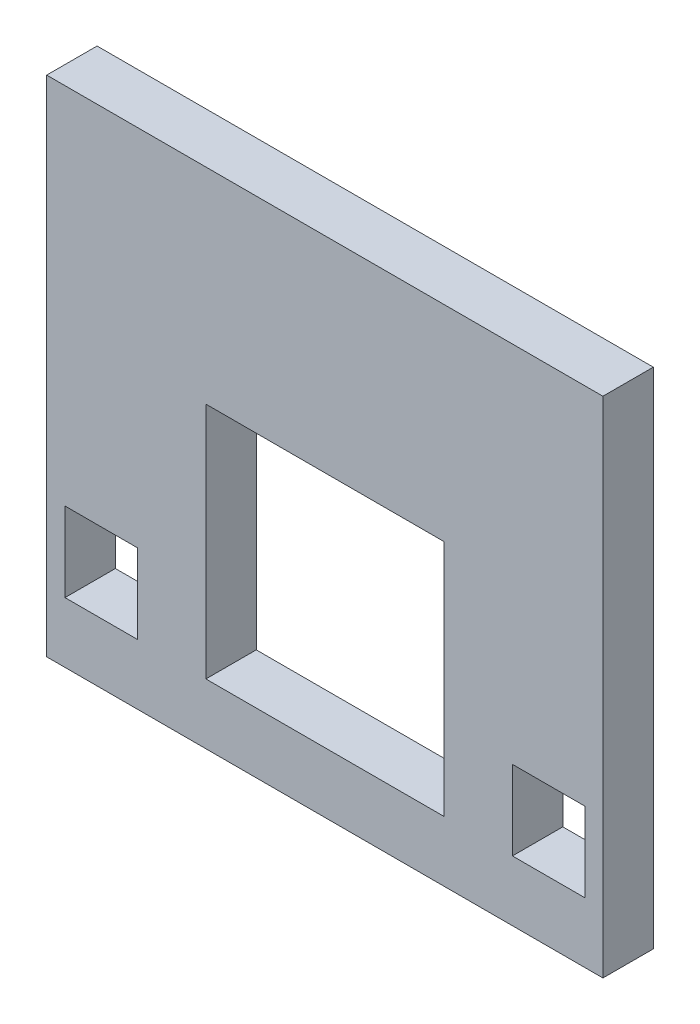
ISO-10303-21;
HEADER;
FILE_DESCRIPTION(('STEP AP214'),'2;1');
FILE_NAME('part.step','',(''),(''),'','','');
FILE_SCHEMA(('AUTOMOTIVE_DESIGN { 1 0 10303 214 1 1 1 1 }'));
ENDSEC;
DATA;
#1=APPLICATION_CONTEXT('core data for automotive mechanical design processes');
#2=APPLICATION_PROTOCOL_DEFINITION('international standard','automotive_design',2000,#1);
#3=PRODUCT_CONTEXT('',#1,'mechanical');
#4=PRODUCT('Part','Part','',(#3));
#5=PRODUCT_RELATED_PRODUCT_CATEGORY('part','',(#4));
#6=PRODUCT_DEFINITION_FORMATION('','',#4);
#7=PRODUCT_DEFINITION_CONTEXT('part definition',#1,'design');
#8=PRODUCT_DEFINITION('design','',#6,#7);
#9=PRODUCT_DEFINITION_SHAPE('','',#8);
#10=(LENGTH_UNIT() NAMED_UNIT(*) SI_UNIT(.MILLI.,.METRE.));
#11=(NAMED_UNIT(*) PLANE_ANGLE_UNIT() SI_UNIT($,.RADIAN.));
#12=(NAMED_UNIT(*) SI_UNIT($,.STERADIAN.) SOLID_ANGLE_UNIT());
#13=UNCERTAINTY_MEASURE_WITH_UNIT(LENGTH_MEASURE(1.E-05),#10,'distance_accuracy_value','');
#14=(GEOMETRIC_REPRESENTATION_CONTEXT(3) GLOBAL_UNCERTAINTY_ASSIGNED_CONTEXT((#13)) GLOBAL_UNIT_ASSIGNED_CONTEXT((#10,
#11,#12)) REPRESENTATION_CONTEXT('',''));
#15=CARTESIAN_POINT('',(0.,0.,0.));
#16=DIRECTION('',(0.,0.,1.));
#17=DIRECTION('',(1.,0.,0.));
#18=AXIS2_PLACEMENT_3D('',#15,#16,#17);
#19=CARTESIAN_POINT('',(9.77039111832267,30.8752429906542,3.175));
#20=DIRECTION('',(1.,0.,0.));
#21=DIRECTION('',(0.,1.,0.));
#22=AXIS2_PLACEMENT_3D('',#19,#20,#21);
#23=PLANE('',#22);
#24=DIRECTION('',(0.,-1.,0.));
#25=VECTOR('',#24,1.);
#26=CARTESIAN_POINT('',(9.77039111832267,30.8752429906542,0.));
#27=LINE('',#26,#25);
#28=CARTESIAN_POINT('',(9.77039111832267,30.8752429906542,0.));
#29=VERTEX_POINT('',#28);
#30=CARTESIAN_POINT('',(9.77039111832267,-0.874757009345785,0.));
#31=VERTEX_POINT('',#30);
#32=EDGE_CURVE('E275',#29,#31,#27,.T.);
#33=ORIENTED_EDGE('',*,*,#32,.T.);
#34=DIRECTION('',(0.,0.,-1.));
#35=VECTOR('',#34,1.);
#36=CARTESIAN_POINT('',(9.77039111832267,-0.874757009345785,3.175));
#37=LINE('',#36,#35);
#38=CARTESIAN_POINT('',(9.77039111832267,-0.874757009345785,3.175));
#39=VERTEX_POINT('',#38);
#40=EDGE_CURVE('E11',#39,#31,#37,.T.);
#41=ORIENTED_EDGE('',*,*,#40,.F.);
#42=DIRECTION('',(0.,-1.,0.));
#43=VECTOR('',#42,1.);
#44=CARTESIAN_POINT('',(9.77039111832267,30.8752429906542,3.175));
#45=LINE('',#44,#43);
#46=CARTESIAN_POINT('',(9.77039111832267,30.8752429906542,3.175));
#47=VERTEX_POINT('',#46);
#48=EDGE_CURVE('E285',#47,#39,#45,.T.);
#49=ORIENTED_EDGE('',*,*,#48,.F.);
#50=DIRECTION('',(0.,0.,-1.));
#51=VECTOR('',#50,1.);
#52=CARTESIAN_POINT('',(9.77039111832267,30.8752429906542,3.175));
#53=LINE('',#52,#51);
#54=EDGE_CURVE('E299',#47,#29,#53,.T.);
#55=ORIENTED_EDGE('',*,*,#54,.T.);
#56=EDGE_LOOP('',(#33,#41,#49,#55));
#57=FACE_BOUND('',#56,.T.);
#58=ADVANCED_FACE('F42',(#57),#23,.F.);
#59=CARTESIAN_POINT('',(9.77039111832267,-0.874757009345785,3.175));
#60=DIRECTION('',(0.,1.,0.));
#61=DIRECTION('',(0.,0.,1.));
#62=AXIS2_PLACEMENT_3D('',#59,#60,#61);
#63=PLANE('',#62);
#64=DIRECTION('',(1.,0.,0.));
#65=VECTOR('',#64,1.);
#66=CARTESIAN_POINT('',(9.77039111832267,-0.874757009345785,0.));
#67=LINE('',#66,#65);
#68=CARTESIAN_POINT('',(44.8223911183227,-0.874757009345785,0.));
#69=VERTEX_POINT('',#68);
#70=EDGE_CURVE('E303',#31,#69,#67,.T.);
#71=ORIENTED_EDGE('',*,*,#70,.T.);
#72=DIRECTION('',(0.,0.,-1.));
#73=VECTOR('',#72,1.);
#74=CARTESIAN_POINT('',(44.8223911183227,-0.874757009345785,3.175));
#75=LINE('',#74,#73);
#76=CARTESIAN_POINT('',(44.8223911183227,-0.874757009345785,3.175));
#77=VERTEX_POINT('',#76);
#78=EDGE_CURVE('E50',#77,#69,#75,.T.);
#79=ORIENTED_EDGE('',*,*,#78,.F.);
#80=DIRECTION('',(1.,0.,0.));
#81=VECTOR('',#80,1.);
#82=CARTESIAN_POINT('',(9.77039111832267,-0.874757009345785,3.175));
#83=LINE('',#82,#81);
#84=EDGE_CURVE('E289',#39,#77,#83,.T.);
#85=ORIENTED_EDGE('',*,*,#84,.F.);
#86=ORIENTED_EDGE('',*,*,#40,.T.);
#87=EDGE_LOOP('',(#71,#79,#85,#86));
#88=FACE_BOUND('',#87,.T.);
#89=ADVANCED_FACE('F338',(#88),#63,.F.);
#90=CARTESIAN_POINT('',(44.8223911183227,30.8752429906542,3.175));
#91=DIRECTION('',(-1.,0.,0.));
#92=DIRECTION('',(0.,-1.,0.));
#93=AXIS2_PLACEMENT_3D('',#90,#91,#92);
#94=PLANE('',#93);
#95=DIRECTION('',(0.,1.,0.));
#96=VECTOR('',#95,1.);
#97=CARTESIAN_POINT('',(44.8223911183227,30.8752429906542,0.));
#98=LINE('',#97,#96);
#99=CARTESIAN_POINT('',(44.8223911183227,30.8752429906542,0.));
#100=VERTEX_POINT('',#99);
#101=EDGE_CURVE('E306',#69,#100,#98,.T.);
#102=ORIENTED_EDGE('',*,*,#101,.T.);
#103=DIRECTION('',(0.,0.,-1.));
#104=VECTOR('',#103,1.);
#105=CARTESIAN_POINT('',(44.8223911183227,30.8752429906542,3.175));
#106=LINE('',#105,#104);
#107=CARTESIAN_POINT('',(44.8223911183227,30.8752429906542,3.175));
#108=VERTEX_POINT('',#107);
#109=EDGE_CURVE('E314',#108,#100,#106,.T.);
#110=ORIENTED_EDGE('',*,*,#109,.F.);
#111=DIRECTION('',(0.,1.,0.));
#112=VECTOR('',#111,1.);
#113=CARTESIAN_POINT('',(44.8223911183227,30.8752429906542,3.175));
#114=LINE('',#113,#112);
#115=EDGE_CURVE('E293',#77,#108,#114,.T.);
#116=ORIENTED_EDGE('',*,*,#115,.F.);
#117=ORIENTED_EDGE('',*,*,#78,.T.);
#118=EDGE_LOOP('',(#102,#110,#116,#117));
#119=FACE_BOUND('',#118,.T.);
#120=ADVANCED_FACE('F323',(#119),#94,.F.);
#121=CARTESIAN_POINT('',(9.77039111832267,30.8752429906542,3.175));
#122=DIRECTION('',(0.,-1.,0.));
#123=DIRECTION('',(0.,0.,-1.));
#124=AXIS2_PLACEMENT_3D('',#121,#122,#123);
#125=PLANE('',#124);
#126=DIRECTION('',(-1.,0.,0.));
#127=VECTOR('',#126,1.);
#128=CARTESIAN_POINT('',(9.77039111832267,30.8752429906542,0.));
#129=LINE('',#128,#127);
#130=EDGE_CURVE('E290',#100,#29,#129,.T.);
#131=ORIENTED_EDGE('',*,*,#130,.T.);
#132=ORIENTED_EDGE('',*,*,#54,.F.);
#133=DIRECTION('',(-1.,0.,0.));
#134=VECTOR('',#133,1.);
#135=CARTESIAN_POINT('',(9.77039111832267,30.8752429906542,3.175));
#136=LINE('',#135,#134);
#137=EDGE_CURVE('E296',#108,#47,#136,.T.);
#138=ORIENTED_EDGE('',*,*,#137,.F.);
#139=ORIENTED_EDGE('',*,*,#109,.T.);
#140=EDGE_LOOP('',(#131,#132,#138,#139));
#141=FACE_BOUND('',#140,.T.);
#142=ADVANCED_FACE('F332',(#141),#125,.F.);
#143=CARTESIAN_POINT('',(0.,0.,3.175));
#144=DIRECTION('',(0.,0.,1.));
#145=DIRECTION('',(1.,0.,0.));
#146=AXIS2_PLACEMENT_3D('',#143,#144,#145);
#147=PLANE('',#146);
#148=DIRECTION('',(0.,1.,0.));
#149=VECTOR('',#148,1.);
#150=CARTESIAN_POINT('',(43.6793911183227,7.93524299065433,3.175));
#151=LINE('',#150,#149);
#152=CARTESIAN_POINT('',(43.6793911183227,2.93524299065421,3.175));
#153=VERTEX_POINT('',#152);
#154=CARTESIAN_POINT('',(43.6793911183227,7.93524299065433,3.175));
#155=VERTEX_POINT('',#154);
#156=EDGE_CURVE('E57',#153,#155,#151,.T.);
#157=ORIENTED_EDGE('',*,*,#156,.F.);
#158=DIRECTION('',(1.,0.,0.));
#159=VECTOR('',#158,1.);
#160=CARTESIAN_POINT('',(39.1193911183227,2.93524299065421,3.175));
#161=LINE('',#160,#159);
#162=CARTESIAN_POINT('',(39.1193911183227,2.93524299065421,3.175));
#163=VERTEX_POINT('',#162);
#164=EDGE_CURVE('E215',#163,#153,#161,.T.);
#165=ORIENTED_EDGE('',*,*,#164,.F.);
#166=DIRECTION('',(0.,-1.,0.));
#167=VECTOR('',#166,1.);
#168=CARTESIAN_POINT('',(39.1193911183227,7.93524299065433,3.175));
#169=LINE('',#168,#167);
#170=CARTESIAN_POINT('',(39.1193911183227,7.93524299065433,3.175));
#171=VERTEX_POINT('',#170);
#172=EDGE_CURVE('E219',#171,#163,#169,.T.);
#173=ORIENTED_EDGE('',*,*,#172,.F.);
#174=DIRECTION('',(-1.,0.,0.));
#175=VECTOR('',#174,1.);
#176=CARTESIAN_POINT('',(39.1193911183227,7.93524299065433,3.175));
#177=LINE('',#176,#175);
#178=EDGE_CURVE('E224',#155,#171,#177,.T.);
#179=ORIENTED_EDGE('',*,*,#178,.F.);
#180=EDGE_LOOP('',(#157,#165,#173,#179));
#181=FACE_BOUND('',#180,.T.);
#182=DIRECTION('',(0.,-1.,0.));
#183=VECTOR('',#182,1.);
#184=CARTESIAN_POINT('',(10.9233911423204,7.93524299065422,3.175));
#185=LINE('',#184,#183);
#186=CARTESIAN_POINT('',(10.9233911423204,7.93524299065422,3.175));
#187=VERTEX_POINT('',#186);
#188=CARTESIAN_POINT('',(10.9233911423204,2.93524299065421,3.175));
#189=VERTEX_POINT('',#188);
#190=EDGE_CURVE('E65',#187,#189,#185,.T.);
#191=ORIENTED_EDGE('',*,*,#190,.F.);
#192=DIRECTION('',(-1.,0.,0.));
#193=VECTOR('',#192,1.);
#194=CARTESIAN_POINT('',(10.9233911423204,7.93524299065422,3.175));
#195=LINE('',#194,#193);
#196=CARTESIAN_POINT('',(15.4833911183227,7.93524299065422,3.175));
#197=VERTEX_POINT('',#196);
#198=EDGE_CURVE('E165',#197,#187,#195,.T.);
#199=ORIENTED_EDGE('',*,*,#198,.F.);
#200=DIRECTION('',(0.,1.,0.));
#201=VECTOR('',#200,1.);
#202=CARTESIAN_POINT('',(15.4833911183227,7.93524299065422,3.175));
#203=LINE('',#202,#201);
#204=CARTESIAN_POINT('',(15.4833911183227,2.93524299065421,3.175));
#205=VERTEX_POINT('',#204);
#206=EDGE_CURVE('E171',#205,#197,#203,.T.);
#207=ORIENTED_EDGE('',*,*,#206,.F.);
#208=DIRECTION('',(1.,0.,0.));
#209=VECTOR('',#208,1.);
#210=CARTESIAN_POINT('',(10.9233911423204,2.93524299065421,3.175));
#211=LINE('',#210,#209);
#212=EDGE_CURVE('E177',#189,#205,#211,.T.);
#213=ORIENTED_EDGE('',*,*,#212,.F.);
#214=EDGE_LOOP('',(#191,#199,#207,#213));
#215=FACE_BOUND('',#214,.T.);
#216=DIRECTION('',(0.,-1.,0.));
#217=VECTOR('',#216,1.);
#218=CARTESIAN_POINT('',(19.8013911183227,17.9352429906542,3.175));
#219=LINE('',#218,#217);
#220=CARTESIAN_POINT('',(19.8013911183227,17.9352429906542,3.175));
#221=VERTEX_POINT('',#220);
#222=CARTESIAN_POINT('',(19.8013911183227,2.93524299065421,3.175));
#223=VERTEX_POINT('',#222);
#224=EDGE_CURVE('E179',#221,#223,#219,.T.);
#225=ORIENTED_EDGE('',*,*,#224,.F.);
#226=DIRECTION('',(-1.,0.,0.));
#227=VECTOR('',#226,1.);
#228=CARTESIAN_POINT('',(19.8013911183227,17.9352429906542,3.175));
#229=LINE('',#228,#227);
#230=CARTESIAN_POINT('',(34.8013911183227,17.9352429906542,3.175));
#231=VERTEX_POINT('',#230);
#232=EDGE_CURVE('E249',#231,#221,#229,.T.);
#233=ORIENTED_EDGE('',*,*,#232,.F.);
#234=DIRECTION('',(0.,1.,0.));
#235=VECTOR('',#234,1.);
#236=CARTESIAN_POINT('',(34.8013911183227,17.9352429906542,3.175));
#237=LINE('',#236,#235);
#238=CARTESIAN_POINT('',(34.8013911183227,2.93524299065421,3.175));
#239=VERTEX_POINT('',#238);
#240=EDGE_CURVE('E265',#239,#231,#237,.T.);
#241=ORIENTED_EDGE('',*,*,#240,.F.);
#242=DIRECTION('',(1.,0.,0.));
#243=VECTOR('',#242,1.);
#244=CARTESIAN_POINT('',(19.8013911183227,2.93524299065421,3.175));
#245=LINE('',#244,#243);
#246=EDGE_CURVE('E183',#223,#239,#245,.T.);
#247=ORIENTED_EDGE('',*,*,#246,.F.);
#248=EDGE_LOOP('',(#225,#233,#241,#247));
#249=FACE_BOUND('',#248,.T.);
#250=ORIENTED_EDGE('',*,*,#48,.T.);
#251=ORIENTED_EDGE('',*,*,#84,.T.);
#252=ORIENTED_EDGE('',*,*,#115,.T.);
#253=ORIENTED_EDGE('',*,*,#137,.T.);
#254=EDGE_LOOP('',(#250,#251,#252,#253));
#255=FACE_BOUND('',#254,.T.);
#256=ADVANCED_FACE('F174',(#181,#215,#249,#255),#147,.T.);
#257=CARTESIAN_POINT('',(0.,0.,0.));
#258=DIRECTION('',(0.,0.,1.));
#259=DIRECTION('',(1.,0.,0.));
#260=AXIS2_PLACEMENT_3D('',#257,#258,#259);
#261=PLANE('',#260);
#262=DIRECTION('',(1.,0.,0.));
#263=VECTOR('',#262,1.);
#264=CARTESIAN_POINT('',(39.1193911183227,2.93524299065421,0.));
#265=LINE('',#264,#263);
#266=CARTESIAN_POINT('',(39.1193911183227,2.93524299065421,0.));
#267=VERTEX_POINT('',#266);
#268=CARTESIAN_POINT('',(43.6793911183227,2.93524299065421,0.));
#269=VERTEX_POINT('',#268);
#270=EDGE_CURVE('E205',#267,#269,#265,.T.);
#271=ORIENTED_EDGE('',*,*,#270,.T.);
#272=DIRECTION('',(0.,1.,0.));
#273=VECTOR('',#272,1.);
#274=CARTESIAN_POINT('',(43.6793911183227,7.93524299065433,0.));
#275=LINE('',#274,#273);
#276=CARTESIAN_POINT('',(43.6793911183227,7.93524299065433,0.));
#277=VERTEX_POINT('',#276);
#278=EDGE_CURVE('E220',#269,#277,#275,.T.);
#279=ORIENTED_EDGE('',*,*,#278,.T.);
#280=DIRECTION('',(-1.,0.,0.));
#281=VECTOR('',#280,1.);
#282=CARTESIAN_POINT('',(39.1193911183227,7.93524299065433,0.));
#283=LINE('',#282,#281);
#284=CARTESIAN_POINT('',(39.1193911183227,7.93524299065433,0.));
#285=VERTEX_POINT('',#284);
#286=EDGE_CURVE('E237',#277,#285,#283,.T.);
#287=ORIENTED_EDGE('',*,*,#286,.T.);
#288=DIRECTION('',(0.,-1.,0.));
#289=VECTOR('',#288,1.);
#290=CARTESIAN_POINT('',(39.1193911183227,7.93524299065433,0.));
#291=LINE('',#290,#289);
#292=EDGE_CURVE('E233',#285,#267,#291,.T.);
#293=ORIENTED_EDGE('',*,*,#292,.T.);
#294=EDGE_LOOP('',(#271,#279,#287,#293));
#295=FACE_BOUND('',#294,.T.);
#296=DIRECTION('',(-1.,0.,0.));
#297=VECTOR('',#296,1.);
#298=CARTESIAN_POINT('',(10.9233911423204,7.93524299065422,0.));
#299=LINE('',#298,#297);
#300=CARTESIAN_POINT('',(15.4833911183227,7.93524299065422,0.));
#301=VERTEX_POINT('',#300);
#302=CARTESIAN_POINT('',(10.9233911423204,7.93524299065422,0.));
#303=VERTEX_POINT('',#302);
#304=EDGE_CURVE('E188',#301,#303,#299,.T.);
#305=ORIENTED_EDGE('',*,*,#304,.T.);
#306=DIRECTION('',(0.,-1.,0.));
#307=VECTOR('',#306,1.);
#308=CARTESIAN_POINT('',(10.9233911423204,7.93524299065422,0.));
#309=LINE('',#308,#307);
#310=CARTESIAN_POINT('',(10.9233911423204,2.93524299065421,0.));
#311=VERTEX_POINT('',#310);
#312=EDGE_CURVE('E157',#303,#311,#309,.T.);
#313=ORIENTED_EDGE('',*,*,#312,.T.);
#314=DIRECTION('',(1.,0.,0.));
#315=VECTOR('',#314,1.);
#316=CARTESIAN_POINT('',(10.9233911423204,2.93524299065421,0.));
#317=LINE('',#316,#315);
#318=CARTESIAN_POINT('',(15.4833911183227,2.93524299065421,0.));
#319=VERTEX_POINT('',#318);
#320=EDGE_CURVE('E196',#311,#319,#317,.T.);
#321=ORIENTED_EDGE('',*,*,#320,.T.);
#322=DIRECTION('',(0.,1.,0.));
#323=VECTOR('',#322,1.);
#324=CARTESIAN_POINT('',(15.4833911183227,7.93524299065422,0.));
#325=LINE('',#324,#323);
#326=EDGE_CURVE('E191',#319,#301,#325,.T.);
#327=ORIENTED_EDGE('',*,*,#326,.T.);
#328=EDGE_LOOP('',(#305,#313,#321,#327));
#329=FACE_BOUND('',#328,.T.);
#330=DIRECTION('',(-1.,0.,0.));
#331=VECTOR('',#330,1.);
#332=CARTESIAN_POINT('',(19.8013911183227,17.9352429906542,0.));
#333=LINE('',#332,#331);
#334=CARTESIAN_POINT('',(34.8013911183227,17.9352429906542,0.));
#335=VERTEX_POINT('',#334);
#336=CARTESIAN_POINT('',(19.8013911183227,17.9352429906542,0.));
#337=VERTEX_POINT('',#336);
#338=EDGE_CURVE('E257',#335,#337,#333,.T.);
#339=ORIENTED_EDGE('',*,*,#338,.T.);
#340=DIRECTION('',(0.,-1.,0.));
#341=VECTOR('',#340,1.);
#342=CARTESIAN_POINT('',(19.8013911183227,17.9352429906542,0.));
#343=LINE('',#342,#341);
#344=CARTESIAN_POINT('',(19.8013911183227,2.93524299065421,0.));
#345=VERTEX_POINT('',#344);
#346=EDGE_CURVE('E244',#337,#345,#343,.T.);
#347=ORIENTED_EDGE('',*,*,#346,.T.);
#348=DIRECTION('',(1.,0.,0.));
#349=VECTOR('',#348,1.);
#350=CARTESIAN_POINT('',(19.8013911183227,2.93524299065421,0.));
#351=LINE('',#350,#349);
#352=CARTESIAN_POINT('',(34.8013911183227,2.93524299065421,0.));
#353=VERTEX_POINT('',#352);
#354=EDGE_CURVE('E248',#345,#353,#351,.T.);
#355=ORIENTED_EDGE('',*,*,#354,.T.);
#356=DIRECTION('',(0.,1.,0.));
#357=VECTOR('',#356,1.);
#358=CARTESIAN_POINT('',(34.8013911183227,17.9352429906542,0.));
#359=LINE('',#358,#357);
#360=EDGE_CURVE('E253',#353,#335,#359,.T.);
#361=ORIENTED_EDGE('',*,*,#360,.T.);
#362=EDGE_LOOP('',(#339,#347,#355,#361));
#363=FACE_BOUND('',#362,.T.);
#364=ORIENTED_EDGE('',*,*,#32,.F.);
#365=ORIENTED_EDGE('',*,*,#130,.F.);
#366=ORIENTED_EDGE('',*,*,#101,.F.);
#367=ORIENTED_EDGE('',*,*,#70,.F.);
#368=EDGE_LOOP('',(#364,#365,#366,#367));
#369=FACE_BOUND('',#368,.T.);
#370=ADVANCED_FACE('F329',(#295,#329,#363,#369),#261,.F.);
#371=CARTESIAN_POINT('',(19.8013911183227,17.9352429906542,0.));
#372=DIRECTION('',(-1.,0.,0.));
#373=DIRECTION('',(0.,-1.,0.));
#374=AXIS2_PLACEMENT_3D('',#371,#372,#373);
#375=PLANE('',#374);
#376=ORIENTED_EDGE('',*,*,#224,.T.);
#377=DIRECTION('',(0.,0.,1.));
#378=VECTOR('',#377,1.);
#379=CARTESIAN_POINT('',(19.8013911183227,2.93524299065421,0.));
#380=LINE('',#379,#378);
#381=EDGE_CURVE('E260',#345,#223,#380,.T.);
#382=ORIENTED_EDGE('',*,*,#381,.F.);
#383=ORIENTED_EDGE('',*,*,#346,.F.);
#384=DIRECTION('',(0.,0.,1.));
#385=VECTOR('',#384,1.);
#386=CARTESIAN_POINT('',(19.8013911183227,17.9352429906542,0.));
#387=LINE('',#386,#385);
#388=EDGE_CURVE('E272',#337,#221,#387,.T.);
#389=ORIENTED_EDGE('',*,*,#388,.T.);
#390=EDGE_LOOP('',(#376,#382,#383,#389));
#391=FACE_BOUND('',#390,.T.);
#392=ADVANCED_FACE('F350',(#391),#375,.F.);
#393=CARTESIAN_POINT('',(19.8013911183227,17.9352429906542,0.));
#394=DIRECTION('',(0.,1.,0.));
#395=DIRECTION('',(0.,0.,1.));
#396=AXIS2_PLACEMENT_3D('',#393,#394,#395);
#397=PLANE('',#396);
#398=ORIENTED_EDGE('',*,*,#232,.T.);
#399=ORIENTED_EDGE('',*,*,#388,.F.);
#400=ORIENTED_EDGE('',*,*,#338,.F.);
#401=DIRECTION('',(0.,0.,1.));
#402=VECTOR('',#401,1.);
#403=CARTESIAN_POINT('',(34.8013911183227,17.9352429906542,0.));
#404=LINE('',#403,#402);
#405=EDGE_CURVE('E276',#335,#231,#404,.T.);
#406=ORIENTED_EDGE('',*,*,#405,.T.);
#407=EDGE_LOOP('',(#398,#399,#400,#406));
#408=FACE_BOUND('',#407,.T.);
#409=ADVANCED_FACE('F357',(#408),#397,.F.);
#410=CARTESIAN_POINT('',(34.8013911183227,17.9352429906542,0.));
#411=DIRECTION('',(1.,0.,0.));
#412=DIRECTION('',(0.,0.,-1.));
#413=AXIS2_PLACEMENT_3D('',#410,#411,#412);
#414=PLANE('',#413);
#415=ORIENTED_EDGE('',*,*,#240,.T.);
#416=ORIENTED_EDGE('',*,*,#405,.F.);
#417=ORIENTED_EDGE('',*,*,#360,.F.);
#418=DIRECTION('',(0.,0.,1.));
#419=VECTOR('',#418,1.);
#420=CARTESIAN_POINT('',(34.8013911183227,2.93524299065421,0.));
#421=LINE('',#420,#419);
#422=EDGE_CURVE('E279',#353,#239,#421,.T.);
#423=ORIENTED_EDGE('',*,*,#422,.T.);
#424=EDGE_LOOP('',(#415,#416,#417,#423));
#425=FACE_BOUND('',#424,.T.);
#426=ADVANCED_FACE('F362',(#425),#414,.F.);
#427=CARTESIAN_POINT('',(19.8013911183227,2.93524299065421,0.));
#428=DIRECTION('',(0.,-1.,0.));
#429=DIRECTION('',(0.,0.,-1.));
#430=AXIS2_PLACEMENT_3D('',#427,#428,#429);
#431=PLANE('',#430);
#432=ORIENTED_EDGE('',*,*,#246,.T.);
#433=ORIENTED_EDGE('',*,*,#422,.F.);
#434=ORIENTED_EDGE('',*,*,#354,.F.);
#435=ORIENTED_EDGE('',*,*,#381,.T.);
#436=EDGE_LOOP('',(#432,#433,#434,#435));
#437=FACE_BOUND('',#436,.T.);
#438=ADVANCED_FACE('F359',(#437),#431,.F.);
#439=CARTESIAN_POINT('',(10.9233911423204,7.93524299065422,0.));
#440=DIRECTION('',(-1.,0.,0.));
#441=DIRECTION('',(0.,0.,1.));
#442=AXIS2_PLACEMENT_3D('',#439,#440,#441);
#443=PLANE('',#442);
#444=ORIENTED_EDGE('',*,*,#190,.T.);
#445=DIRECTION('',(0.,0.,1.));
#446=VECTOR('',#445,1.);
#447=CARTESIAN_POINT('',(10.9233911423204,2.93524299065421,0.));
#448=LINE('',#447,#446);
#449=EDGE_CURVE('E192',#311,#189,#448,.T.);
#450=ORIENTED_EDGE('',*,*,#449,.F.);
#451=ORIENTED_EDGE('',*,*,#312,.F.);
#452=DIRECTION('',(0.,0.,1.));
#453=VECTOR('',#452,1.);
#454=CARTESIAN_POINT('',(10.9233911423204,7.93524299065422,0.));
#455=LINE('',#454,#453);
#456=EDGE_CURVE('E153',#303,#187,#455,.T.);
#457=ORIENTED_EDGE('',*,*,#456,.T.);
#458=EDGE_LOOP('',(#444,#450,#451,#457));
#459=FACE_BOUND('',#458,.T.);
#460=ADVANCED_FACE('F155',(#459),#443,.F.);
#461=CARTESIAN_POINT('',(10.9233911423204,7.93524299065422,0.));
#462=DIRECTION('',(0.,1.,0.));
#463=DIRECTION('',(0.,0.,1.));
#464=AXIS2_PLACEMENT_3D('',#461,#462,#463);
#465=PLANE('',#464);
#466=ORIENTED_EDGE('',*,*,#198,.T.);
#467=ORIENTED_EDGE('',*,*,#456,.F.);
#468=ORIENTED_EDGE('',*,*,#304,.F.);
#469=DIRECTION('',(0.,0.,1.));
#470=VECTOR('',#469,1.);
#471=CARTESIAN_POINT('',(15.4833911183227,7.93524299065422,0.));
#472=LINE('',#471,#470);
#473=EDGE_CURVE('E162',#301,#197,#472,.T.);
#474=ORIENTED_EDGE('',*,*,#473,.T.);
#475=EDGE_LOOP('',(#466,#467,#468,#474));
#476=FACE_BOUND('',#475,.T.);
#477=ADVANCED_FACE('F166',(#476),#465,.F.);
#478=CARTESIAN_POINT('',(15.4833911183227,7.93524299065422,0.));
#479=DIRECTION('',(1.,0.,0.));
#480=DIRECTION('',(0.,0.,-1.));
#481=AXIS2_PLACEMENT_3D('',#478,#479,#480);
#482=PLANE('',#481);
#483=ORIENTED_EDGE('',*,*,#206,.T.);
#484=ORIENTED_EDGE('',*,*,#473,.F.);
#485=ORIENTED_EDGE('',*,*,#326,.F.);
#486=DIRECTION('',(0.,0.,1.));
#487=VECTOR('',#486,1.);
#488=CARTESIAN_POINT('',(15.4833911183227,2.93524299065421,0.));
#489=LINE('',#488,#487);
#490=EDGE_CURVE('E540',#319,#205,#489,.T.);
#491=ORIENTED_EDGE('',*,*,#490,.T.);
#492=EDGE_LOOP('',(#483,#484,#485,#491));
#493=FACE_BOUND('',#492,.T.);
#494=ADVANCED_FACE('F388',(#493),#482,.F.);
#495=CARTESIAN_POINT('',(10.9233911423204,2.93524299065421,0.));
#496=DIRECTION('',(0.,-1.,0.));
#497=DIRECTION('',(1.,0.,0.));
#498=AXIS2_PLACEMENT_3D('',#495,#496,#497);
#499=PLANE('',#498);
#500=ORIENTED_EDGE('',*,*,#212,.T.);
#501=ORIENTED_EDGE('',*,*,#490,.F.);
#502=ORIENTED_EDGE('',*,*,#320,.F.);
#503=ORIENTED_EDGE('',*,*,#449,.T.);
#504=EDGE_LOOP('',(#500,#501,#502,#503));
#505=FACE_BOUND('',#504,.T.);
#506=ADVANCED_FACE('F385',(#505),#499,.F.);
#507=CARTESIAN_POINT('',(43.6793911183227,7.93524299065433,0.));
#508=DIRECTION('',(1.,0.,0.));
#509=DIRECTION('',(0.,1.,0.));
#510=AXIS2_PLACEMENT_3D('',#507,#508,#509);
#511=PLANE('',#510);
#512=ORIENTED_EDGE('',*,*,#156,.T.);
#513=DIRECTION('',(0.,0.,1.));
#514=VECTOR('',#513,1.);
#515=CARTESIAN_POINT('',(43.6793911183227,7.93524299065433,0.));
#516=LINE('',#515,#514);
#517=EDGE_CURVE('E202',#277,#155,#516,.T.);
#518=ORIENTED_EDGE('',*,*,#517,.F.);
#519=ORIENTED_EDGE('',*,*,#278,.F.);
#520=DIRECTION('',(0.,0.,1.));
#521=VECTOR('',#520,1.);
#522=CARTESIAN_POINT('',(43.6793911183227,2.93524299065421,0.));
#523=LINE('',#522,#521);
#524=EDGE_CURVE('E212',#269,#153,#523,.T.);
#525=ORIENTED_EDGE('',*,*,#524,.T.);
#526=EDGE_LOOP('',(#512,#518,#519,#525));
#527=FACE_BOUND('',#526,.T.);
#528=ADVANCED_FACE('F374',(#527),#511,.F.);
#529=CARTESIAN_POINT('',(39.1193911183227,2.93524299065421,0.));
#530=DIRECTION('',(0.,-1.,0.));
#531=DIRECTION('',(0.,0.,-1.));
#532=AXIS2_PLACEMENT_3D('',#529,#530,#531);
#533=PLANE('',#532);
#534=ORIENTED_EDGE('',*,*,#164,.T.);
#535=ORIENTED_EDGE('',*,*,#524,.F.);
#536=ORIENTED_EDGE('',*,*,#270,.F.);
#537=DIRECTION('',(0.,0.,1.));
#538=VECTOR('',#537,1.);
#539=CARTESIAN_POINT('',(39.1193911183227,2.93524299065421,0.));
#540=LINE('',#539,#538);
#541=EDGE_CURVE('E209',#267,#163,#540,.T.);
#542=ORIENTED_EDGE('',*,*,#541,.T.);
#543=EDGE_LOOP('',(#534,#535,#536,#542));
#544=FACE_BOUND('',#543,.T.);
#545=ADVANCED_FACE('F370',(#544),#533,.F.);
#546=CARTESIAN_POINT('',(39.1193911183227,7.93524299065433,0.));
#547=DIRECTION('',(-1.,0.,0.));
#548=DIRECTION('',(0.,0.,1.));
#549=AXIS2_PLACEMENT_3D('',#546,#547,#548);
#550=PLANE('',#549);
#551=ORIENTED_EDGE('',*,*,#172,.T.);
#552=ORIENTED_EDGE('',*,*,#541,.F.);
#553=ORIENTED_EDGE('',*,*,#292,.F.);
#554=DIRECTION('',(0.,0.,1.));
#555=VECTOR('',#554,1.);
#556=CARTESIAN_POINT('',(39.1193911183227,7.93524299065433,0.));
#557=LINE('',#556,#555);
#558=EDGE_CURVE('E206',#285,#171,#557,.T.);
#559=ORIENTED_EDGE('',*,*,#558,.T.);
#560=EDGE_LOOP('',(#551,#552,#553,#559));
#561=FACE_BOUND('',#560,.T.);
#562=ADVANCED_FACE('F373',(#561),#550,.F.);
#563=CARTESIAN_POINT('',(39.1193911183227,7.93524299065433,0.));
#564=DIRECTION('',(0.,1.,0.));
#565=DIRECTION('',(0.,0.,1.));
#566=AXIS2_PLACEMENT_3D('',#563,#564,#565);
#567=PLANE('',#566);
#568=ORIENTED_EDGE('',*,*,#178,.T.);
#569=ORIENTED_EDGE('',*,*,#558,.F.);
#570=ORIENTED_EDGE('',*,*,#286,.F.);
#571=ORIENTED_EDGE('',*,*,#517,.T.);
#572=EDGE_LOOP('',(#568,#569,#570,#571));
#573=FACE_BOUND('',#572,.T.);
#574=ADVANCED_FACE('F378',(#573),#567,.F.);
#575=CLOSED_SHELL('',(#58,#89,#120,#142,#256,#370,#392,#409,#426,#438,#460,#477,#494,#506,#528,
#545,#562,#574));
#576=MANIFOLD_SOLID_BREP('B2',#575);
#577=ADVANCED_BREP_SHAPE_REPRESENTATION('',(#18,#576),#14);
#578=SHAPE_DEFINITION_REPRESENTATION(#9,#577);
ENDSEC;
END-ISO-10303-21;
